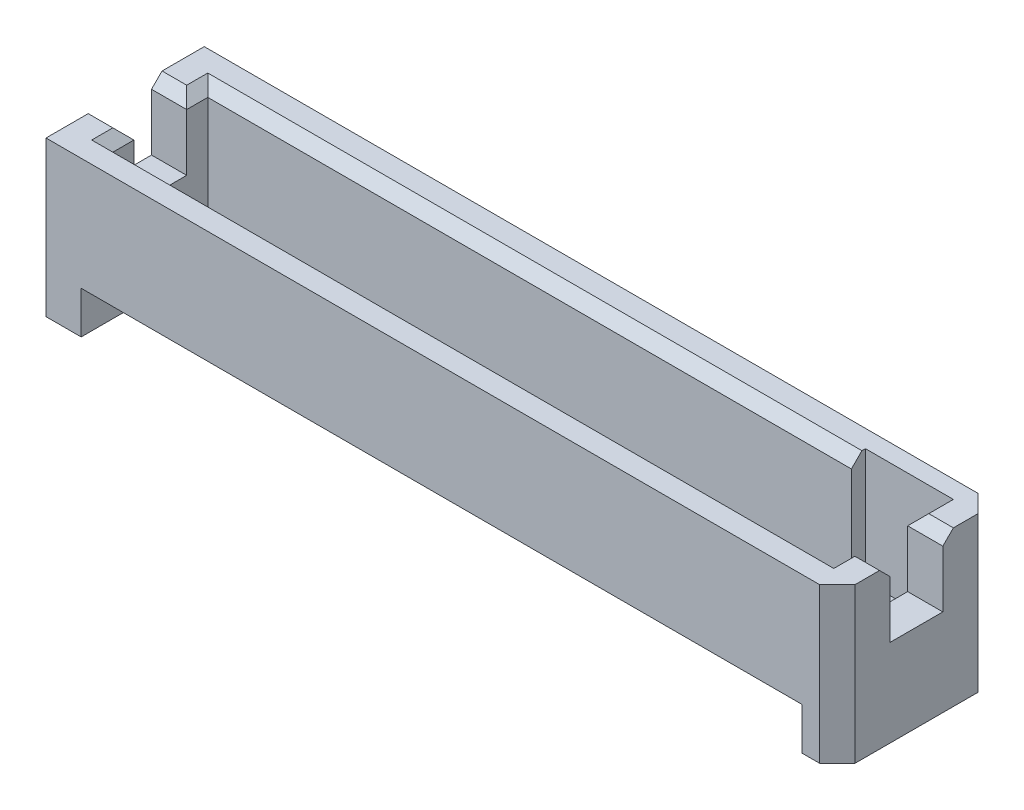
ISO-10303-21;
HEADER;
FILE_DESCRIPTION(('STEP AP214'),'2;1');
FILE_NAME('part.step','',(''),(''),'','','');
FILE_SCHEMA(('AUTOMOTIVE_DESIGN { 1 0 10303 214 1 1 1 1 }'));
ENDSEC;
DATA;
#1=APPLICATION_CONTEXT('core data for automotive mechanical design processes');
#2=APPLICATION_PROTOCOL_DEFINITION('international standard','automotive_design',2000,#1);
#3=PRODUCT_CONTEXT('',#1,'mechanical');
#4=PRODUCT('Part','Part','',(#3));
#5=PRODUCT_RELATED_PRODUCT_CATEGORY('part','',(#4));
#6=PRODUCT_DEFINITION_FORMATION('','',#4);
#7=PRODUCT_DEFINITION_CONTEXT('part definition',#1,'design');
#8=PRODUCT_DEFINITION('design','',#6,#7);
#9=PRODUCT_DEFINITION_SHAPE('','',#8);
#10=(LENGTH_UNIT() NAMED_UNIT(*) SI_UNIT(.MILLI.,.METRE.));
#11=(NAMED_UNIT(*) PLANE_ANGLE_UNIT() SI_UNIT($,.RADIAN.));
#12=(NAMED_UNIT(*) SI_UNIT($,.STERADIAN.) SOLID_ANGLE_UNIT());
#13=UNCERTAINTY_MEASURE_WITH_UNIT(LENGTH_MEASURE(1.E-05),#10,'distance_accuracy_value','');
#14=(GEOMETRIC_REPRESENTATION_CONTEXT(3) GLOBAL_UNCERTAINTY_ASSIGNED_CONTEXT((#13)) GLOBAL_UNIT_ASSIGNED_CONTEXT((#10,
#11,#12)) REPRESENTATION_CONTEXT('',''));
#15=CARTESIAN_POINT('',(0.,0.,0.));
#16=DIRECTION('',(0.,0.,1.));
#17=DIRECTION('',(1.,0.,0.));
#18=AXIS2_PLACEMENT_3D('',#15,#16,#17);
#19=CARTESIAN_POINT('',(13.6525,5.588,2.8575));
#20=DIRECTION('',(-0.707106781186547,0.,-0.707106781186548));
#21=DIRECTION('',(-0.707106781186548,0.,0.707106781186547));
#22=AXIS2_PLACEMENT_3D('',#19,#20,#21);
#23=PLANE('',#22);
#24=DIRECTION('',(0.707106781186548,0.,-0.707106781186547));
#25=VECTOR('',#24,1.);
#26=CARTESIAN_POINT('',(13.6525,0.,2.8575));
#27=LINE('',#26,#25);
#28=CARTESIAN_POINT('',(13.6525,0.,2.8575));
#29=VERTEX_POINT('',#28);
#30=CARTESIAN_POINT('',(14.2875,0.,2.2225));
#31=VERTEX_POINT('',#30);
#32=EDGE_CURVE('E11',#29,#31,#27,.T.);
#33=ORIENTED_EDGE('',*,*,#32,.T.);
#34=DIRECTION('',(0.,-1.,0.));
#35=VECTOR('',#34,1.);
#36=CARTESIAN_POINT('',(14.2875,5.588,2.2225));
#37=LINE('',#36,#35);
#38=CARTESIAN_POINT('',(14.2875,5.588,2.2225));
#39=VERTEX_POINT('',#38);
#40=EDGE_CURVE('E24',#39,#31,#37,.T.);
#41=ORIENTED_EDGE('',*,*,#40,.F.);
#42=DIRECTION('',(0.707106781186548,0.,-0.707106781186547));
#43=VECTOR('',#42,1.);
#44=CARTESIAN_POINT('',(13.6525,5.588,2.8575));
#45=LINE('',#44,#43);
#46=CARTESIAN_POINT('',(13.6525,5.588,2.8575));
#47=VERTEX_POINT('',#46);
#48=EDGE_CURVE('E660',#47,#39,#45,.T.);
#49=ORIENTED_EDGE('',*,*,#48,.F.);
#50=DIRECTION('',(0.,-1.,0.));
#51=VECTOR('',#50,1.);
#52=CARTESIAN_POINT('',(13.6525,5.588,2.8575));
#53=LINE('',#52,#51);
#54=EDGE_CURVE('E656',#47,#29,#53,.T.);
#55=ORIENTED_EDGE('',*,*,#54,.T.);
#56=EDGE_LOOP('',(#33,#41,#49,#55));
#57=FACE_BOUND('',#56,.T.);
#58=ADVANCED_FACE('F16',(#57),#23,.F.);
#59=CARTESIAN_POINT('',(-14.2875,5.588,2.8575));
#60=DIRECTION('',(0.,0.,-1.));
#61=DIRECTION('',(-1.,0.,0.));
#62=AXIS2_PLACEMENT_3D('',#59,#60,#61);
#63=PLANE('',#62);
#64=DIRECTION('',(-1.,0.,0.));
#65=VECTOR('',#64,1.);
#66=CARTESIAN_POINT('',(13.0175,1.524,2.8575));
#67=LINE('',#66,#65);
#68=CARTESIAN_POINT('',(13.0175,1.524,2.8575));
#69=VERTEX_POINT('',#68);
#70=CARTESIAN_POINT('',(-13.0175,1.524,2.8575));
#71=VERTEX_POINT('',#70);
#72=EDGE_CURVE('E651',#69,#71,#67,.T.);
#73=ORIENTED_EDGE('',*,*,#72,.F.);
#74=DIRECTION('',(0.,-1.,0.));
#75=VECTOR('',#74,1.);
#76=CARTESIAN_POINT('',(13.0175,1.524,2.8575));
#77=LINE('',#76,#75);
#78=CARTESIAN_POINT('',(13.0175,0.,2.8575));
#79=VERTEX_POINT('',#78);
#80=EDGE_CURVE('E647',#69,#79,#77,.T.);
#81=ORIENTED_EDGE('',*,*,#80,.T.);
#82=DIRECTION('',(1.,0.,0.));
#83=VECTOR('',#82,1.);
#84=CARTESIAN_POINT('',(-14.2875,0.,2.8575));
#85=LINE('',#84,#83);
#86=EDGE_CURVE('E642',#79,#29,#85,.T.);
#87=ORIENTED_EDGE('',*,*,#86,.T.);
#88=ORIENTED_EDGE('',*,*,#54,.F.);
#89=DIRECTION('',(1.,0.,0.));
#90=VECTOR('',#89,1.);
#91=CARTESIAN_POINT('',(-14.2875,5.588,2.8575));
#92=LINE('',#91,#90);
#93=CARTESIAN_POINT('',(-14.2875,5.588,2.8575));
#94=VERTEX_POINT('',#93);
#95=EDGE_CURVE('E637',#94,#47,#92,.T.);
#96=ORIENTED_EDGE('',*,*,#95,.F.);
#97=DIRECTION('',(0.,-1.,0.));
#98=VECTOR('',#97,1.);
#99=CARTESIAN_POINT('',(-14.2875,5.588,2.8575));
#100=LINE('',#99,#98);
#101=CARTESIAN_POINT('',(-14.2875,0.,2.8575));
#102=VERTEX_POINT('',#101);
#103=EDGE_CURVE('E633',#94,#102,#100,.T.);
#104=ORIENTED_EDGE('',*,*,#103,.T.);
#105=DIRECTION('',(1.,0.,0.));
#106=VECTOR('',#105,1.);
#107=CARTESIAN_POINT('',(-14.2875,0.,2.8575));
#108=LINE('',#107,#106);
#109=CARTESIAN_POINT('',(-13.0175,0.,2.8575));
#110=VERTEX_POINT('',#109);
#111=EDGE_CURVE('E629',#102,#110,#108,.T.);
#112=ORIENTED_EDGE('',*,*,#111,.T.);
#113=DIRECTION('',(0.,-1.,0.));
#114=VECTOR('',#113,1.);
#115=CARTESIAN_POINT('',(-13.0175,1.524,2.8575));
#116=LINE('',#115,#114);
#117=EDGE_CURVE('E624',#71,#110,#116,.T.);
#118=ORIENTED_EDGE('',*,*,#117,.F.);
#119=EDGE_LOOP('',(#73,#81,#87,#88,#96,#104,#112,#118));
#120=FACE_BOUND('',#119,.T.);
#121=ADVANCED_FACE('F676',(#120),#63,.F.);
#122=CARTESIAN_POINT('',(-13.0175,0.,0.));
#123=DIRECTION('',(1.,0.,0.));
#124=DIRECTION('',(0.,0.,-1.));
#125=AXIS2_PLACEMENT_3D('',#122,#123,#124);
#126=PLANE('',#125);
#127=DIRECTION('',(0.,0.496138938356834,0.868243142124459));
#128=VECTOR('',#127,1.);
#129=CARTESIAN_POINT('',(-13.0175,0.508,1.0795));
#130=LINE('',#129,#128);
#131=CARTESIAN_POINT('',(-13.0175,0.508,1.0795));
#132=VERTEX_POINT('',#131);
#133=EDGE_CURVE('E619',#132,#71,#130,.T.);
#134=ORIENTED_EDGE('',*,*,#133,.T.);
#135=ORIENTED_EDGE('',*,*,#117,.T.);
#136=DIRECTION('',(0.,0.,-1.));
#137=VECTOR('',#136,1.);
#138=CARTESIAN_POINT('',(-13.0175,0.,2.8575));
#139=LINE('',#138,#137);
#140=CARTESIAN_POINT('',(-13.0175,0.,-2.8575));
#141=VERTEX_POINT('',#140);
#142=EDGE_CURVE('E615',#110,#141,#139,.T.);
#143=ORIENTED_EDGE('',*,*,#142,.T.);
#144=DIRECTION('',(0.,1.,0.));
#145=VECTOR('',#144,1.);
#146=CARTESIAN_POINT('',(-13.0175,0.,-2.8575));
#147=LINE('',#146,#145);
#148=CARTESIAN_POINT('',(-13.0175,1.524,-2.8575));
#149=VERTEX_POINT('',#148);
#150=EDGE_CURVE('E611',#141,#149,#147,.T.);
#151=ORIENTED_EDGE('',*,*,#150,.T.);
#152=DIRECTION('',(0.,-0.496138938356834,0.868243142124459));
#153=VECTOR('',#152,1.);
#154=CARTESIAN_POINT('',(-13.0175,1.524,-2.8575));
#155=LINE('',#154,#153);
#156=CARTESIAN_POINT('',(-13.0175,0.508,-1.0795));
#157=VERTEX_POINT('',#156);
#158=EDGE_CURVE('E607',#149,#157,#155,.T.);
#159=ORIENTED_EDGE('',*,*,#158,.T.);
#160=DIRECTION('',(0.,0.,1.));
#161=VECTOR('',#160,1.);
#162=CARTESIAN_POINT('',(-13.0175,0.508,-1.0795));
#163=LINE('',#162,#161);
#164=EDGE_CURVE('E603',#157,#132,#163,.T.);
#165=ORIENTED_EDGE('',*,*,#164,.T.);
#166=EDGE_LOOP('',(#134,#135,#143,#151,#159,#165));
#167=FACE_BOUND('',#166,.T.);
#168=ADVANCED_FACE('F806',(#167),#126,.T.);
#169=CARTESIAN_POINT('',(13.0175,0.508,-1.0795));
#170=DIRECTION('',(0.,-1.,0.));
#171=DIRECTION('',(0.,0.,-1.));
#172=AXIS2_PLACEMENT_3D('',#169,#170,#171);
#173=PLANE('',#172);
#174=ORIENTED_EDGE('',*,*,#164,.F.);
#175=DIRECTION('',(-1.,0.,0.));
#176=VECTOR('',#175,1.);
#177=CARTESIAN_POINT('',(13.0175,0.508,-1.0795));
#178=LINE('',#177,#176);
#179=CARTESIAN_POINT('',(13.0175,0.508,-1.0795));
#180=VERTEX_POINT('',#179);
#181=EDGE_CURVE('E598',#180,#157,#178,.T.);
#182=ORIENTED_EDGE('',*,*,#181,.F.);
#183=DIRECTION('',(0.,0.,1.));
#184=VECTOR('',#183,1.);
#185=CARTESIAN_POINT('',(13.0175,0.508,-1.0795));
#186=LINE('',#185,#184);
#187=CARTESIAN_POINT('',(13.0175,0.508,1.0795));
#188=VERTEX_POINT('',#187);
#189=EDGE_CURVE('E594',#180,#188,#186,.T.);
#190=ORIENTED_EDGE('',*,*,#189,.T.);
#191=DIRECTION('',(-1.,0.,0.));
#192=VECTOR('',#191,1.);
#193=CARTESIAN_POINT('',(13.0175,0.508,1.0795));
#194=LINE('',#193,#192);
#195=EDGE_CURVE('E589',#188,#132,#194,.T.);
#196=ORIENTED_EDGE('',*,*,#195,.T.);
#197=EDGE_LOOP('',(#174,#182,#190,#196));
#198=FACE_BOUND('',#197,.T.);
#199=ADVANCED_FACE('F810',(#198),#173,.T.);
#200=CARTESIAN_POINT('',(13.0175,0.508,1.0795));
#201=DIRECTION('',(0.,-0.868243142124459,0.496138938356834));
#202=DIRECTION('',(0.,-0.496138938356834,-0.868243142124459));
#203=AXIS2_PLACEMENT_3D('',#200,#201,#202);
#204=PLANE('',#203);
#205=ORIENTED_EDGE('',*,*,#133,.F.);
#206=ORIENTED_EDGE('',*,*,#195,.F.);
#207=DIRECTION('',(0.,0.496138938356834,0.868243142124459));
#208=VECTOR('',#207,1.);
#209=CARTESIAN_POINT('',(13.0175,0.508,1.0795));
#210=LINE('',#209,#208);
#211=EDGE_CURVE('E584',#188,#69,#210,.T.);
#212=ORIENTED_EDGE('',*,*,#211,.T.);
#213=ORIENTED_EDGE('',*,*,#72,.T.);
#214=EDGE_LOOP('',(#205,#206,#212,#213));
#215=FACE_BOUND('',#214,.T.);
#216=ADVANCED_FACE('F816',(#215),#204,.T.);
#217=CARTESIAN_POINT('',(13.0175,0.,0.));
#218=DIRECTION('',(1.,0.,0.));
#219=DIRECTION('',(0.,0.,-1.));
#220=AXIS2_PLACEMENT_3D('',#217,#218,#219);
#221=PLANE('',#220);
#222=ORIENTED_EDGE('',*,*,#211,.F.);
#223=ORIENTED_EDGE('',*,*,#189,.F.);
#224=DIRECTION('',(0.,-0.496138938356834,0.868243142124459));
#225=VECTOR('',#224,1.);
#226=CARTESIAN_POINT('',(13.0175,1.524,-2.8575));
#227=LINE('',#226,#225);
#228=CARTESIAN_POINT('',(13.0175,1.524,-2.8575));
#229=VERTEX_POINT('',#228);
#230=EDGE_CURVE('E579',#229,#180,#227,.T.);
#231=ORIENTED_EDGE('',*,*,#230,.F.);
#232=DIRECTION('',(0.,1.,0.));
#233=VECTOR('',#232,1.);
#234=CARTESIAN_POINT('',(13.0175,0.,-2.8575));
#235=LINE('',#234,#233);
#236=CARTESIAN_POINT('',(13.0175,0.,-2.8575));
#237=VERTEX_POINT('',#236);
#238=EDGE_CURVE('E574',#237,#229,#235,.T.);
#239=ORIENTED_EDGE('',*,*,#238,.F.);
#240=DIRECTION('',(0.,0.,-1.));
#241=VECTOR('',#240,1.);
#242=CARTESIAN_POINT('',(13.0175,0.,2.8575));
#243=LINE('',#242,#241);
#244=EDGE_CURVE('E569',#79,#237,#243,.T.);
#245=ORIENTED_EDGE('',*,*,#244,.F.);
#246=ORIENTED_EDGE('',*,*,#80,.F.);
#247=EDGE_LOOP('',(#222,#223,#231,#239,#245,#246));
#248=FACE_BOUND('',#247,.T.);
#249=ADVANCED_FACE('F820',(#248),#221,.F.);
#250=CARTESIAN_POINT('',(0.,0.,0.));
#251=DIRECTION('',(0.,1.,0.));
#252=DIRECTION('',(0.,0.,1.));
#253=AXIS2_PLACEMENT_3D('',#250,#251,#252);
#254=PLANE('',#253);
#255=ORIENTED_EDGE('',*,*,#86,.F.);
#256=ORIENTED_EDGE('',*,*,#244,.T.);
#257=DIRECTION('',(-1.,0.,0.));
#258=VECTOR('',#257,1.);
#259=CARTESIAN_POINT('',(13.6525,0.,-2.8575));
#260=LINE('',#259,#258);
#261=CARTESIAN_POINT('',(13.6525,0.,-2.8575));
#262=VERTEX_POINT('',#261);
#263=EDGE_CURVE('E564',#262,#237,#260,.T.);
#264=ORIENTED_EDGE('',*,*,#263,.F.);
#265=DIRECTION('',(-0.707106781186548,0.,-0.707106781186547));
#266=VECTOR('',#265,1.);
#267=CARTESIAN_POINT('',(14.2875,0.,-2.2225));
#268=LINE('',#267,#266);
#269=CARTESIAN_POINT('',(14.2875,0.,-2.2225));
#270=VERTEX_POINT('',#269);
#271=EDGE_CURVE('E559',#270,#262,#268,.T.);
#272=ORIENTED_EDGE('',*,*,#271,.F.);
#273=DIRECTION('',(0.,0.,-1.));
#274=VECTOR('',#273,1.);
#275=CARTESIAN_POINT('',(14.2875,0.,2.2225));
#276=LINE('',#275,#274);
#277=EDGE_CURVE('E554',#31,#270,#276,.T.);
#278=ORIENTED_EDGE('',*,*,#277,.F.);
#279=ORIENTED_EDGE('',*,*,#32,.F.);
#280=EDGE_LOOP('',(#255,#256,#264,#272,#278,#279));
#281=FACE_BOUND('',#280,.T.);
#282=ADVANCED_FACE('F681',(#281),#254,.F.);
#283=CARTESIAN_POINT('',(14.2875,5.588,2.2225));
#284=DIRECTION('',(-1.,0.,0.));
#285=DIRECTION('',(0.,0.,1.));
#286=AXIS2_PLACEMENT_3D('',#283,#284,#285);
#287=PLANE('',#286);
#288=DIRECTION('',(0.,-0.707106781186548,-0.707106781186547));
#289=VECTOR('',#288,1.);
#290=CARTESIAN_POINT('',(14.2875,5.588,1.3335));
#291=LINE('',#290,#289);
#292=CARTESIAN_POINT('',(14.2875,5.588,1.3335));
#293=VERTEX_POINT('',#292);
#294=CARTESIAN_POINT('',(14.2875,5.207,0.9525));
#295=VERTEX_POINT('',#294);
#296=EDGE_CURVE('E549',#293,#295,#291,.T.);
#297=ORIENTED_EDGE('',*,*,#296,.F.);
#298=DIRECTION('',(0.,0.,-1.));
#299=VECTOR('',#298,1.);
#300=CARTESIAN_POINT('',(14.2875,5.588,2.2225));
#301=LINE('',#300,#299);
#302=EDGE_CURVE('E544',#39,#293,#301,.T.);
#303=ORIENTED_EDGE('',*,*,#302,.F.);
#304=ORIENTED_EDGE('',*,*,#40,.T.);
#305=ORIENTED_EDGE('',*,*,#277,.T.);
#306=DIRECTION('',(0.,-1.,0.));
#307=VECTOR('',#306,1.);
#308=CARTESIAN_POINT('',(14.2875,5.588,-2.2225));
#309=LINE('',#308,#307);
#310=CARTESIAN_POINT('',(14.2875,5.588,-2.2225));
#311=VERTEX_POINT('',#310);
#312=EDGE_CURVE('E539',#311,#270,#309,.T.);
#313=ORIENTED_EDGE('',*,*,#312,.F.);
#314=DIRECTION('',(0.,0.,-1.));
#315=VECTOR('',#314,1.);
#316=CARTESIAN_POINT('',(14.2875,5.588,2.2225));
#317=LINE('',#316,#315);
#318=CARTESIAN_POINT('',(14.2875,5.588,-1.3335));
#319=VERTEX_POINT('',#318);
#320=EDGE_CURVE('E534',#319,#311,#317,.T.);
#321=ORIENTED_EDGE('',*,*,#320,.F.);
#322=DIRECTION('',(0.,0.707106781186548,-0.707106781186547));
#323=VECTOR('',#322,1.);
#324=CARTESIAN_POINT('',(14.2875,5.207,-0.9525));
#325=LINE('',#324,#323);
#326=CARTESIAN_POINT('',(14.2875,5.207,-0.9525));
#327=VERTEX_POINT('',#326);
#328=EDGE_CURVE('E529',#327,#319,#325,.T.);
#329=ORIENTED_EDGE('',*,*,#328,.F.);
#330=DIRECTION('',(0.,-1.,0.));
#331=VECTOR('',#330,1.);
#332=CARTESIAN_POINT('',(14.2875,8.0264,-0.9525));
#333=LINE('',#332,#331);
#334=CARTESIAN_POINT('',(14.2875,3.1496,-0.9525));
#335=VERTEX_POINT('',#334);
#336=EDGE_CURVE('E525',#327,#335,#333,.T.);
#337=ORIENTED_EDGE('',*,*,#336,.T.);
#338=DIRECTION('',(0.,0.,-1.));
#339=VECTOR('',#338,1.);
#340=CARTESIAN_POINT('',(14.2875,3.1496,0.9525));
#341=LINE('',#340,#339);
#342=CARTESIAN_POINT('',(14.2875,3.1496,0.9525));
#343=VERTEX_POINT('',#342);
#344=EDGE_CURVE('E520',#343,#335,#341,.T.);
#345=ORIENTED_EDGE('',*,*,#344,.F.);
#346=DIRECTION('',(0.,-1.,0.));
#347=VECTOR('',#346,1.);
#348=CARTESIAN_POINT('',(14.2875,8.0264,0.9525));
#349=LINE('',#348,#347);
#350=EDGE_CURVE('E515',#295,#343,#349,.T.);
#351=ORIENTED_EDGE('',*,*,#350,.F.);
#352=EDGE_LOOP('',(#297,#303,#304,#305,#313,#321,#329,#337,#345,#351));
#353=FACE_BOUND('',#352,.T.);
#354=ADVANCED_FACE('F670',(#353),#287,.F.);
#355=CARTESIAN_POINT('',(-14.2875,8.0264,0.9525));
#356=DIRECTION('',(0.,0.,-1.));
#357=DIRECTION('',(-1.,0.,0.));
#358=AXIS2_PLACEMENT_3D('',#355,#356,#357);
#359=PLANE('',#358);
#360=DIRECTION('',(0.,-1.,0.));
#361=VECTOR('',#360,1.);
#362=CARTESIAN_POINT('',(13.0175,8.0264,0.9525));
#363=LINE('',#362,#361);
#364=CARTESIAN_POINT('',(13.0175,5.207,0.9525));
#365=VERTEX_POINT('',#364);
#366=CARTESIAN_POINT('',(13.0175,3.1496,0.9525));
#367=VERTEX_POINT('',#366);
#368=EDGE_CURVE('E510',#365,#367,#363,.T.);
#369=ORIENTED_EDGE('',*,*,#368,.F.);
#370=DIRECTION('',(-1.,0.,0.));
#371=VECTOR('',#370,1.);
#372=CARTESIAN_POINT('',(14.2875,5.207,0.9525));
#373=LINE('',#372,#371);
#374=EDGE_CURVE('E505',#295,#365,#373,.T.);
#375=ORIENTED_EDGE('',*,*,#374,.F.);
#376=ORIENTED_EDGE('',*,*,#350,.T.);
#377=DIRECTION('',(1.,0.,0.));
#378=VECTOR('',#377,1.);
#379=CARTESIAN_POINT('',(-14.2875,3.1496,0.9525));
#380=LINE('',#379,#378);
#381=EDGE_CURVE('E500',#367,#343,#380,.T.);
#382=ORIENTED_EDGE('',*,*,#381,.F.);
#383=EDGE_LOOP('',(#369,#375,#376,#382));
#384=FACE_BOUND('',#383,.T.);
#385=ADVANCED_FACE('F790',(#384),#359,.T.);
#386=CARTESIAN_POINT('',(0.,3.1496,0.));
#387=DIRECTION('',(0.,1.,0.));
#388=DIRECTION('',(0.,0.,1.));
#389=AXIS2_PLACEMENT_3D('',#386,#387,#388);
#390=PLANE('',#389);
#391=DIRECTION('',(0.,0.,-1.));
#392=VECTOR('',#391,1.);
#393=CARTESIAN_POINT('',(13.0175,3.1496,0.));
#394=LINE('',#393,#392);
#395=CARTESIAN_POINT('',(13.0175,3.1496,-0.9525));
#396=VERTEX_POINT('',#395);
#397=EDGE_CURVE('E495',#367,#396,#394,.T.);
#398=ORIENTED_EDGE('',*,*,#397,.F.);
#399=ORIENTED_EDGE('',*,*,#381,.T.);
#400=ORIENTED_EDGE('',*,*,#344,.T.);
#401=DIRECTION('',(-1.,0.,0.));
#402=VECTOR('',#401,1.);
#403=CARTESIAN_POINT('',(14.2875,3.1496,-0.9525));
#404=LINE('',#403,#402);
#405=EDGE_CURVE('E491',#335,#396,#404,.T.);
#406=ORIENTED_EDGE('',*,*,#405,.T.);
#407=EDGE_LOOP('',(#398,#399,#400,#406));
#408=FACE_BOUND('',#407,.T.);
#409=ADVANCED_FACE('F792',(#408),#390,.T.);
#410=CARTESIAN_POINT('',(14.2875,8.0264,-0.9525));
#411=DIRECTION('',(0.,0.,1.));
#412=DIRECTION('',(1.,0.,0.));
#413=AXIS2_PLACEMENT_3D('',#410,#411,#412);
#414=PLANE('',#413);
#415=ORIENTED_EDGE('',*,*,#336,.F.);
#416=DIRECTION('',(-1.,0.,0.));
#417=VECTOR('',#416,1.);
#418=CARTESIAN_POINT('',(14.2875,5.207,-0.9525));
#419=LINE('',#418,#417);
#420=CARTESIAN_POINT('',(13.0175,5.207,-0.9525));
#421=VERTEX_POINT('',#420);
#422=EDGE_CURVE('E487',#327,#421,#419,.T.);
#423=ORIENTED_EDGE('',*,*,#422,.T.);
#424=DIRECTION('',(0.,1.,0.));
#425=VECTOR('',#424,1.);
#426=CARTESIAN_POINT('',(13.0175,8.0264,-0.9525));
#427=LINE('',#426,#425);
#428=EDGE_CURVE('E482',#396,#421,#427,.T.);
#429=ORIENTED_EDGE('',*,*,#428,.F.);
#430=ORIENTED_EDGE('',*,*,#405,.F.);
#431=EDGE_LOOP('',(#415,#423,#429,#430));
#432=FACE_BOUND('',#431,.T.);
#433=ADVANCED_FACE('F697',(#432),#414,.T.);
#434=CARTESIAN_POINT('',(13.0175,1.4351,1.7145));
#435=DIRECTION('',(1.,0.,0.));
#436=DIRECTION('',(0.,0.,-1.));
#437=AXIS2_PLACEMENT_3D('',#434,#435,#436);
#438=PLANE('',#437);
#439=ORIENTED_EDGE('',*,*,#397,.T.);
#440=ORIENTED_EDGE('',*,*,#428,.T.);
#441=DIRECTION('',(0.,0.,-1.));
#442=VECTOR('',#441,1.);
#443=CARTESIAN_POINT('',(13.0175,5.207,1.7145));
#444=LINE('',#443,#442);
#445=CARTESIAN_POINT('',(13.0175,5.207,-2.2225));
#446=VERTEX_POINT('',#445);
#447=EDGE_CURVE('E478',#421,#446,#444,.T.);
#448=ORIENTED_EDGE('',*,*,#447,.T.);
#449=DIRECTION('',(0.,1.,0.));
#450=VECTOR('',#449,1.);
#451=CARTESIAN_POINT('',(13.0175,1.4351,-2.2225));
#452=LINE('',#451,#450);
#453=CARTESIAN_POINT('',(13.0175,1.4351,-2.2225));
#454=VERTEX_POINT('',#453);
#455=EDGE_CURVE('E474',#454,#446,#452,.T.);
#456=ORIENTED_EDGE('',*,*,#455,.F.);
#457=DIRECTION('',(0.,0.,-1.));
#458=VECTOR('',#457,1.);
#459=CARTESIAN_POINT('',(13.0175,1.4351,1.7145));
#460=LINE('',#459,#458);
#461=CARTESIAN_POINT('',(13.0175,1.4351,1.7145));
#462=VERTEX_POINT('',#461);
#463=EDGE_CURVE('E232',#462,#454,#460,.T.);
#464=ORIENTED_EDGE('',*,*,#463,.F.);
#465=DIRECTION('',(0.,1.,0.));
#466=VECTOR('',#465,1.);
#467=CARTESIAN_POINT('',(13.0175,1.4351,1.7145));
#468=LINE('',#467,#466);
#469=CARTESIAN_POINT('',(13.0175,5.207,1.7145));
#470=VERTEX_POINT('',#469);
#471=EDGE_CURVE('E467',#462,#470,#468,.T.);
#472=ORIENTED_EDGE('',*,*,#471,.T.);
#473=DIRECTION('',(0.,0.,-1.));
#474=VECTOR('',#473,1.);
#475=CARTESIAN_POINT('',(13.0175,5.207,1.7145));
#476=LINE('',#475,#474);
#477=EDGE_CURVE('E462',#470,#365,#476,.T.);
#478=ORIENTED_EDGE('',*,*,#477,.T.);
#479=ORIENTED_EDGE('',*,*,#368,.T.);
#480=EDGE_LOOP('',(#439,#440,#448,#456,#464,#472,#478,#479));
#481=FACE_BOUND('',#480,.T.);
#482=ADVANCED_FACE('F701',(#481),#438,.F.);
#483=CARTESIAN_POINT('',(13.0175,5.207,1.7145));
#484=DIRECTION('',(-0.707106781186548,0.707106781186548,0.));
#485=DIRECTION('',(-0.707106781186548,-0.707106781186548,0.));
#486=AXIS2_PLACEMENT_3D('',#483,#484,#485);
#487=PLANE('',#486);
#488=DIRECTION('',(0.,0.,-1.));
#489=VECTOR('',#488,1.);
#490=CARTESIAN_POINT('',(13.3985,5.588,1.7145));
#491=LINE('',#490,#489);
#492=CARTESIAN_POINT('',(13.3985,5.588,2.0955));
#493=VERTEX_POINT('',#492);
#494=CARTESIAN_POINT('',(13.3985,5.588,1.3335));
#495=VERTEX_POINT('',#494);
#496=EDGE_CURVE('E458',#493,#495,#491,.T.);
#497=ORIENTED_EDGE('',*,*,#496,.T.);
#498=DIRECTION('',(-0.577350269189626,-0.577350269189626,-0.577350269189625));
#499=VECTOR('',#498,1.);
#500=CARTESIAN_POINT('',(13.2715,5.461,1.2065));
#501=LINE('',#500,#499);
#502=EDGE_CURVE('E453',#495,#365,#501,.T.);
#503=ORIENTED_EDGE('',*,*,#502,.T.);
#504=ORIENTED_EDGE('',*,*,#477,.F.);
#505=DIRECTION('',(-0.577350269189626,-0.577350269189626,-0.577350269189626));
#506=VECTOR('',#505,1.);
#507=CARTESIAN_POINT('',(13.0175,5.207,1.7145));
#508=LINE('',#507,#506);
#509=EDGE_CURVE('E448',#493,#470,#508,.T.);
#510=ORIENTED_EDGE('',*,*,#509,.F.);
#511=EDGE_LOOP('',(#497,#503,#504,#510));
#512=FACE_BOUND('',#511,.T.);
#513=ADVANCED_FACE('F787',(#512),#487,.T.);
#514=CARTESIAN_POINT('',(-13.0175,5.207,1.7145));
#515=DIRECTION('',(0.,0.707106781186548,-0.707106781186548));
#516=DIRECTION('',(0.,0.707106781186548,0.707106781186548));
#517=AXIS2_PLACEMENT_3D('',#514,#515,#516);
#518=PLANE('',#517);
#519=DIRECTION('',(1.,0.,0.));
#520=VECTOR('',#519,1.);
#521=CARTESIAN_POINT('',(-13.0175,5.207,1.7145));
#522=LINE('',#521,#520);
#523=CARTESIAN_POINT('',(-13.0175,5.207,1.7145));
#524=VERTEX_POINT('',#523);
#525=EDGE_CURVE('E443',#524,#470,#522,.T.);
#526=ORIENTED_EDGE('',*,*,#525,.F.);
#527=DIRECTION('',(0.577350269189626,-0.577350269189626,-0.577350269189626));
#528=VECTOR('',#527,1.);
#529=CARTESIAN_POINT('',(-13.0175,5.207,1.7145));
#530=LINE('',#529,#528);
#531=CARTESIAN_POINT('',(-13.3985,5.588,2.0955));
#532=VERTEX_POINT('',#531);
#533=EDGE_CURVE('E438',#532,#524,#530,.T.);
#534=ORIENTED_EDGE('',*,*,#533,.F.);
#535=DIRECTION('',(1.,0.,0.));
#536=VECTOR('',#535,1.);
#537=CARTESIAN_POINT('',(-13.0175,5.588,2.0955));
#538=LINE('',#537,#536);
#539=EDGE_CURVE('E433',#532,#493,#538,.T.);
#540=ORIENTED_EDGE('',*,*,#539,.T.);
#541=ORIENTED_EDGE('',*,*,#509,.T.);
#542=EDGE_LOOP('',(#526,#534,#540,#541));
#543=FACE_BOUND('',#542,.T.);
#544=ADVANCED_FACE('F713',(#543),#518,.T.);
#545=CARTESIAN_POINT('',(0.,5.588,0.));
#546=DIRECTION('',(0.,1.,0.));
#547=DIRECTION('',(0.,0.,1.));
#548=AXIS2_PLACEMENT_3D('',#545,#546,#547);
#549=PLANE('',#548);
#550=ORIENTED_EDGE('',*,*,#302,.T.);
#551=DIRECTION('',(-1.,0.,0.));
#552=VECTOR('',#551,1.);
#553=CARTESIAN_POINT('',(14.2875,5.588,1.3335));
#554=LINE('',#553,#552);
#555=EDGE_CURVE('E428',#293,#495,#554,.T.);
#556=ORIENTED_EDGE('',*,*,#555,.T.);
#557=ORIENTED_EDGE('',*,*,#496,.F.);
#558=ORIENTED_EDGE('',*,*,#539,.F.);
#559=DIRECTION('',(0.,0.,1.));
#560=VECTOR('',#559,1.);
#561=CARTESIAN_POINT('',(-13.3985,5.588,-1.7145));
#562=LINE('',#561,#560);
#563=CARTESIAN_POINT('',(-13.3985,5.588,1.3335));
#564=VERTEX_POINT('',#563);
#565=EDGE_CURVE('E423',#564,#532,#562,.T.);
#566=ORIENTED_EDGE('',*,*,#565,.F.);
#567=DIRECTION('',(-1.,0.,0.));
#568=VECTOR('',#567,1.);
#569=CARTESIAN_POINT('',(14.2875,5.588,1.3335));
#570=LINE('',#569,#568);
#571=CARTESIAN_POINT('',(-14.2875,5.588,1.3335));
#572=VERTEX_POINT('',#571);
#573=EDGE_CURVE('E419',#564,#572,#570,.T.);
#574=ORIENTED_EDGE('',*,*,#573,.T.);
#575=DIRECTION('',(0.,0.,1.));
#576=VECTOR('',#575,1.);
#577=CARTESIAN_POINT('',(-14.2875,5.588,-2.8575));
#578=LINE('',#577,#576);
#579=EDGE_CURVE('E414',#572,#94,#578,.T.);
#580=ORIENTED_EDGE('',*,*,#579,.T.);
#581=ORIENTED_EDGE('',*,*,#95,.T.);
#582=ORIENTED_EDGE('',*,*,#48,.T.);
#583=EDGE_LOOP('',(#550,#556,#557,#558,#566,#574,#580,#581,#582));
#584=FACE_BOUND('',#583,.T.);
#585=ADVANCED_FACE('F673',(#584),#549,.T.);
#586=CARTESIAN_POINT('',(-14.2875,5.588,-2.8575));
#587=DIRECTION('',(1.,0.,0.));
#588=DIRECTION('',(0.,0.,-1.));
#589=AXIS2_PLACEMENT_3D('',#586,#587,#588);
#590=PLANE('',#589);
#591=DIRECTION('',(0.,-0.707106781186548,-0.707106781186547));
#592=VECTOR('',#591,1.);
#593=CARTESIAN_POINT('',(-14.2875,5.588,1.3335));
#594=LINE('',#593,#592);
#595=CARTESIAN_POINT('',(-14.2875,5.207,0.9525));
#596=VERTEX_POINT('',#595);
#597=EDGE_CURVE('E410',#572,#596,#594,.T.);
#598=ORIENTED_EDGE('',*,*,#597,.T.);
#599=DIRECTION('',(0.,-1.,0.));
#600=VECTOR('',#599,1.);
#601=CARTESIAN_POINT('',(-14.2875,8.0264,0.9525));
#602=LINE('',#601,#600);
#603=CARTESIAN_POINT('',(-14.2875,3.1496,0.9525));
#604=VERTEX_POINT('',#603);
#605=EDGE_CURVE('E406',#596,#604,#602,.T.);
#606=ORIENTED_EDGE('',*,*,#605,.T.);
#607=DIRECTION('',(0.,0.,1.));
#608=VECTOR('',#607,1.);
#609=CARTESIAN_POINT('',(-14.2875,3.1496,-0.9525));
#610=LINE('',#609,#608);
#611=CARTESIAN_POINT('',(-14.2875,3.1496,-0.9525));
#612=VERTEX_POINT('',#611);
#613=EDGE_CURVE('E401',#612,#604,#610,.T.);
#614=ORIENTED_EDGE('',*,*,#613,.F.);
#615=DIRECTION('',(0.,-1.,0.));
#616=VECTOR('',#615,1.);
#617=CARTESIAN_POINT('',(-14.2875,8.0264,-0.9525));
#618=LINE('',#617,#616);
#619=CARTESIAN_POINT('',(-14.2875,5.207,-0.9525));
#620=VERTEX_POINT('',#619);
#621=EDGE_CURVE('E396',#620,#612,#618,.T.);
#622=ORIENTED_EDGE('',*,*,#621,.F.);
#623=DIRECTION('',(0.,0.707106781186548,-0.707106781186547));
#624=VECTOR('',#623,1.);
#625=CARTESIAN_POINT('',(-14.2875,5.207,-0.9525));
#626=LINE('',#625,#624);
#627=CARTESIAN_POINT('',(-14.2875,5.588,-1.3335));
#628=VERTEX_POINT('',#627);
#629=EDGE_CURVE('E392',#620,#628,#626,.T.);
#630=ORIENTED_EDGE('',*,*,#629,.T.);
#631=DIRECTION('',(0.,0.,1.));
#632=VECTOR('',#631,1.);
#633=CARTESIAN_POINT('',(-14.2875,5.588,-2.8575));
#634=LINE('',#633,#632);
#635=CARTESIAN_POINT('',(-14.2875,5.588,-2.8575));
#636=VERTEX_POINT('',#635);
#637=EDGE_CURVE('E387',#636,#628,#634,.T.);
#638=ORIENTED_EDGE('',*,*,#637,.F.);
#639=DIRECTION('',(0.,-1.,0.));
#640=VECTOR('',#639,1.);
#641=CARTESIAN_POINT('',(-14.2875,5.588,-2.8575));
#642=LINE('',#641,#640);
#643=CARTESIAN_POINT('',(-14.2875,0.,-2.8575));
#644=VERTEX_POINT('',#643);
#645=EDGE_CURVE('E383',#636,#644,#642,.T.);
#646=ORIENTED_EDGE('',*,*,#645,.T.);
#647=DIRECTION('',(0.,0.,1.));
#648=VECTOR('',#647,1.);
#649=CARTESIAN_POINT('',(-14.2875,0.,-2.8575));
#650=LINE('',#649,#648);
#651=EDGE_CURVE('E378',#644,#102,#650,.T.);
#652=ORIENTED_EDGE('',*,*,#651,.T.);
#653=ORIENTED_EDGE('',*,*,#103,.F.);
#654=ORIENTED_EDGE('',*,*,#579,.F.);
#655=EDGE_LOOP('',(#598,#606,#614,#622,#630,#638,#646,#652,#653,#654));
#656=FACE_BOUND('',#655,.T.);
#657=ADVANCED_FACE('F781',(#656),#590,.F.);
#658=CARTESIAN_POINT('',(0.,0.,0.));
#659=DIRECTION('',(0.,1.,0.));
#660=DIRECTION('',(0.,0.,1.));
#661=AXIS2_PLACEMENT_3D('',#658,#659,#660);
#662=PLANE('',#661);
#663=ORIENTED_EDGE('',*,*,#142,.F.);
#664=ORIENTED_EDGE('',*,*,#111,.F.);
#665=ORIENTED_EDGE('',*,*,#651,.F.);
#666=DIRECTION('',(-1.,0.,0.));
#667=VECTOR('',#666,1.);
#668=CARTESIAN_POINT('',(13.6525,0.,-2.8575));
#669=LINE('',#668,#667);
#670=EDGE_CURVE('E373',#141,#644,#669,.T.);
#671=ORIENTED_EDGE('',*,*,#670,.F.);
#672=EDGE_LOOP('',(#663,#664,#665,#671));
#673=FACE_BOUND('',#672,.T.);
#674=ADVANCED_FACE('F892',(#673),#662,.F.);
#675=CARTESIAN_POINT('',(13.6525,5.588,-2.8575));
#676=DIRECTION('',(0.,0.,1.));
#677=DIRECTION('',(1.,0.,0.));
#678=AXIS2_PLACEMENT_3D('',#675,#676,#677);
#679=PLANE('',#678);
#680=ORIENTED_EDGE('',*,*,#263,.T.);
#681=ORIENTED_EDGE('',*,*,#238,.T.);
#682=DIRECTION('',(-1.,0.,0.));
#683=VECTOR('',#682,1.);
#684=CARTESIAN_POINT('',(13.0175,1.524,-2.8575));
#685=LINE('',#684,#683);
#686=EDGE_CURVE('E368',#229,#149,#685,.T.);
#687=ORIENTED_EDGE('',*,*,#686,.T.);
#688=ORIENTED_EDGE('',*,*,#150,.F.);
#689=ORIENTED_EDGE('',*,*,#670,.T.);
#690=ORIENTED_EDGE('',*,*,#645,.F.);
#691=DIRECTION('',(-1.,0.,0.));
#692=VECTOR('',#691,1.);
#693=CARTESIAN_POINT('',(13.6525,5.588,-2.8575));
#694=LINE('',#693,#692);
#695=CARTESIAN_POINT('',(13.6525,5.588,-2.8575));
#696=VERTEX_POINT('',#695);
#697=EDGE_CURVE('E363',#696,#636,#694,.T.);
#698=ORIENTED_EDGE('',*,*,#697,.F.);
#699=DIRECTION('',(0.,-1.,0.));
#700=VECTOR('',#699,1.);
#701=CARTESIAN_POINT('',(13.6525,5.588,-2.8575));
#702=LINE('',#701,#700);
#703=EDGE_CURVE('E358',#696,#262,#702,.T.);
#704=ORIENTED_EDGE('',*,*,#703,.T.);
#705=EDGE_LOOP('',(#680,#681,#687,#688,#689,#690,#698,#704));
#706=FACE_BOUND('',#705,.T.);
#707=ADVANCED_FACE('F901',(#706),#679,.F.);
#708=CARTESIAN_POINT('',(14.2875,5.588,-2.2225));
#709=DIRECTION('',(-0.707106781186547,0.,0.707106781186548));
#710=DIRECTION('',(0.707106781186548,0.,0.707106781186547));
#711=AXIS2_PLACEMENT_3D('',#708,#709,#710);
#712=PLANE('',#711);
#713=ORIENTED_EDGE('',*,*,#271,.T.);
#714=ORIENTED_EDGE('',*,*,#703,.F.);
#715=DIRECTION('',(-0.707106781186548,0.,-0.707106781186547));
#716=VECTOR('',#715,1.);
#717=CARTESIAN_POINT('',(14.2875,5.588,-2.2225));
#718=LINE('',#717,#716);
#719=EDGE_CURVE('E353',#311,#696,#718,.T.);
#720=ORIENTED_EDGE('',*,*,#719,.F.);
#721=ORIENTED_EDGE('',*,*,#312,.T.);
#722=EDGE_LOOP('',(#713,#714,#720,#721));
#723=FACE_BOUND('',#722,.T.);
#724=ADVANCED_FACE('F684',(#723),#712,.F.);
#725=CARTESIAN_POINT('',(0.,5.588,0.));
#726=DIRECTION('',(0.,1.,0.));
#727=DIRECTION('',(0.,0.,1.));
#728=AXIS2_PLACEMENT_3D('',#725,#726,#727);
#729=PLANE('',#728);
#730=DIRECTION('',(0.,0.,1.));
#731=VECTOR('',#730,1.);
#732=CARTESIAN_POINT('',(10.2235,5.588,-2.2225));
#733=LINE('',#732,#731);
#734=CARTESIAN_POINT('',(10.2235,5.588,-2.2225));
#735=VERTEX_POINT('',#734);
#736=CARTESIAN_POINT('',(10.2235,5.588,-2.0955));
#737=VERTEX_POINT('',#736);
#738=EDGE_CURVE('E349',#735,#737,#733,.T.);
#739=ORIENTED_EDGE('',*,*,#738,.F.);
#740=DIRECTION('',(-1.,0.,0.));
#741=VECTOR('',#740,1.);
#742=CARTESIAN_POINT('',(13.3985,5.588,-2.2225));
#743=LINE('',#742,#741);
#744=CARTESIAN_POINT('',(13.3985,5.588,-2.2225));
#745=VERTEX_POINT('',#744);
#746=EDGE_CURVE('E251',#745,#735,#743,.T.);
#747=ORIENTED_EDGE('',*,*,#746,.F.);
#748=DIRECTION('',(0.,0.,-1.));
#749=VECTOR('',#748,1.);
#750=CARTESIAN_POINT('',(13.3985,5.588,1.7145));
#751=LINE('',#750,#749);
#752=CARTESIAN_POINT('',(13.3985,5.588,-1.3335));
#753=VERTEX_POINT('',#752);
#754=EDGE_CURVE('E341',#753,#745,#751,.T.);
#755=ORIENTED_EDGE('',*,*,#754,.F.);
#756=DIRECTION('',(-1.,0.,0.));
#757=VECTOR('',#756,1.);
#758=CARTESIAN_POINT('',(14.2875,5.588,-1.3335));
#759=LINE('',#758,#757);
#760=EDGE_CURVE('E336',#319,#753,#759,.T.);
#761=ORIENTED_EDGE('',*,*,#760,.F.);
#762=ORIENTED_EDGE('',*,*,#320,.T.);
#763=ORIENTED_EDGE('',*,*,#719,.T.);
#764=ORIENTED_EDGE('',*,*,#697,.T.);
#765=ORIENTED_EDGE('',*,*,#637,.T.);
#766=DIRECTION('',(-1.,0.,0.));
#767=VECTOR('',#766,1.);
#768=CARTESIAN_POINT('',(14.2875,5.588,-1.3335));
#769=LINE('',#768,#767);
#770=CARTESIAN_POINT('',(-13.3985,5.588,-1.3335));
#771=VERTEX_POINT('',#770);
#772=EDGE_CURVE('E331',#771,#628,#769,.T.);
#773=ORIENTED_EDGE('',*,*,#772,.F.);
#774=DIRECTION('',(0.,0.,1.));
#775=VECTOR('',#774,1.);
#776=CARTESIAN_POINT('',(-13.3985,5.588,-1.7145));
#777=LINE('',#776,#775);
#778=CARTESIAN_POINT('',(-13.3985,5.588,-2.0955));
#779=VERTEX_POINT('',#778);
#780=EDGE_CURVE('E326',#779,#771,#777,.T.);
#781=ORIENTED_EDGE('',*,*,#780,.F.);
#782=DIRECTION('',(-1.,0.,0.));
#783=VECTOR('',#782,1.);
#784=CARTESIAN_POINT('',(13.0175,5.588,-2.0955));
#785=LINE('',#784,#783);
#786=EDGE_CURVE('E321',#737,#779,#785,.T.);
#787=ORIENTED_EDGE('',*,*,#786,.F.);
#788=EDGE_LOOP('',(#739,#747,#755,#761,#762,#763,#764,#765,#773,#781,#787));
#789=FACE_BOUND('',#788,.T.);
#790=ADVANCED_FACE('F689',(#789),#729,.T.);
#791=CARTESIAN_POINT('',(13.0175,5.207,-1.7145));
#792=DIRECTION('',(0.,0.707106781186548,0.707106781186548));
#793=DIRECTION('',(0.,-0.707106781186548,0.707106781186548));
#794=AXIS2_PLACEMENT_3D('',#791,#792,#793);
#795=PLANE('',#794);
#796=DIRECTION('',(0.,-0.707106781186548,0.707106781186548));
#797=VECTOR('',#796,1.);
#798=CARTESIAN_POINT('',(10.2235,5.207,-1.7145));
#799=LINE('',#798,#797);
#800=CARTESIAN_POINT('',(10.2235,5.207,-1.7145));
#801=VERTEX_POINT('',#800);
#802=EDGE_CURVE('E317',#737,#801,#799,.T.);
#803=ORIENTED_EDGE('',*,*,#802,.F.);
#804=ORIENTED_EDGE('',*,*,#786,.T.);
#805=DIRECTION('',(0.577350269189626,-0.577350269189626,0.577350269189626));
#806=VECTOR('',#805,1.);
#807=CARTESIAN_POINT('',(-13.0175,5.207,-1.7145));
#808=LINE('',#807,#806);
#809=CARTESIAN_POINT('',(-13.0175,5.207,-1.7145));
#810=VERTEX_POINT('',#809);
#811=EDGE_CURVE('E313',#779,#810,#808,.T.);
#812=ORIENTED_EDGE('',*,*,#811,.T.);
#813=DIRECTION('',(-1.,0.,0.));
#814=VECTOR('',#813,1.);
#815=CARTESIAN_POINT('',(13.0175,5.207,-1.7145));
#816=LINE('',#815,#814);
#817=EDGE_CURVE('E308',#801,#810,#816,.T.);
#818=ORIENTED_EDGE('',*,*,#817,.F.);
#819=EDGE_LOOP('',(#803,#804,#812,#818));
#820=FACE_BOUND('',#819,.T.);
#821=ADVANCED_FACE('F928',(#820),#795,.T.);
#822=CARTESIAN_POINT('',(13.0175,1.4351,-1.7145));
#823=DIRECTION('',(0.,0.,-1.));
#824=DIRECTION('',(-1.,0.,0.));
#825=AXIS2_PLACEMENT_3D('',#822,#823,#824);
#826=PLANE('',#825);
#827=DIRECTION('',(-1.,0.,0.));
#828=VECTOR('',#827,1.);
#829=CARTESIAN_POINT('',(13.0175,1.4351,-1.7145));
#830=LINE('',#829,#828);
#831=CARTESIAN_POINT('',(10.2235,1.4351,-1.7145));
#832=VERTEX_POINT('',#831);
#833=CARTESIAN_POINT('',(-13.0175,1.4351,-1.7145));
#834=VERTEX_POINT('',#833);
#835=EDGE_CURVE('E304',#832,#834,#830,.T.);
#836=ORIENTED_EDGE('',*,*,#835,.F.);
#837=DIRECTION('',(0.,1.,0.));
#838=VECTOR('',#837,1.);
#839=CARTESIAN_POINT('',(10.2235,1.4351,-1.7145));
#840=LINE('',#839,#838);
#841=EDGE_CURVE('E246',#832,#801,#840,.T.);
#842=ORIENTED_EDGE('',*,*,#841,.T.);
#843=ORIENTED_EDGE('',*,*,#817,.T.);
#844=DIRECTION('',(0.,1.,0.));
#845=VECTOR('',#844,1.);
#846=CARTESIAN_POINT('',(-13.0175,1.4351,-1.7145));
#847=LINE('',#846,#845);
#848=EDGE_CURVE('E296',#834,#810,#847,.T.);
#849=ORIENTED_EDGE('',*,*,#848,.F.);
#850=EDGE_LOOP('',(#836,#842,#843,#849));
#851=FACE_BOUND('',#850,.T.);
#852=ADVANCED_FACE('F937',(#851),#826,.F.);
#853=CARTESIAN_POINT('',(-13.0175,1.4351,-1.7145));
#854=DIRECTION('',(-1.,0.,0.));
#855=DIRECTION('',(0.,0.,1.));
#856=AXIS2_PLACEMENT_3D('',#853,#854,#855);
#857=PLANE('',#856);
#858=DIRECTION('',(0.,0.,1.));
#859=VECTOR('',#858,1.);
#860=CARTESIAN_POINT('',(-13.0175,5.207,-1.7145));
#861=LINE('',#860,#859);
#862=CARTESIAN_POINT('',(-13.0175,5.207,-0.9525));
#863=VERTEX_POINT('',#862);
#864=EDGE_CURVE('E292',#810,#863,#861,.T.);
#865=ORIENTED_EDGE('',*,*,#864,.T.);
#866=DIRECTION('',(0.,-1.,0.));
#867=VECTOR('',#866,1.);
#868=CARTESIAN_POINT('',(-13.0175,8.0264,-0.9525));
#869=LINE('',#868,#867);
#870=CARTESIAN_POINT('',(-13.0175,3.1496,-0.9525));
#871=VERTEX_POINT('',#870);
#872=EDGE_CURVE('E288',#863,#871,#869,.T.);
#873=ORIENTED_EDGE('',*,*,#872,.T.);
#874=DIRECTION('',(0.,0.,1.));
#875=VECTOR('',#874,1.);
#876=CARTESIAN_POINT('',(-13.0175,3.1496,0.));
#877=LINE('',#876,#875);
#878=CARTESIAN_POINT('',(-13.0175,3.1496,0.9525));
#879=VERTEX_POINT('',#878);
#880=EDGE_CURVE('E284',#871,#879,#877,.T.);
#881=ORIENTED_EDGE('',*,*,#880,.T.);
#882=DIRECTION('',(0.,1.,0.));
#883=VECTOR('',#882,1.);
#884=CARTESIAN_POINT('',(-13.0175,8.0264,0.9525));
#885=LINE('',#884,#883);
#886=CARTESIAN_POINT('',(-13.0175,5.207,0.9525));
#887=VERTEX_POINT('',#886);
#888=EDGE_CURVE('E280',#879,#887,#885,.T.);
#889=ORIENTED_EDGE('',*,*,#888,.T.);
#890=DIRECTION('',(0.,0.,1.));
#891=VECTOR('',#890,1.);
#892=CARTESIAN_POINT('',(-13.0175,5.207,-1.7145));
#893=LINE('',#892,#891);
#894=EDGE_CURVE('E275',#887,#524,#893,.T.);
#895=ORIENTED_EDGE('',*,*,#894,.T.);
#896=DIRECTION('',(0.,1.,0.));
#897=VECTOR('',#896,1.);
#898=CARTESIAN_POINT('',(-13.0175,1.4351,1.7145));
#899=LINE('',#898,#897);
#900=CARTESIAN_POINT('',(-13.0175,1.4351,1.7145));
#901=VERTEX_POINT('',#900);
#902=EDGE_CURVE('E270',#901,#524,#899,.T.);
#903=ORIENTED_EDGE('',*,*,#902,.F.);
#904=DIRECTION('',(0.,0.,1.));
#905=VECTOR('',#904,1.);
#906=CARTESIAN_POINT('',(-13.0175,1.4351,-1.7145));
#907=LINE('',#906,#905);
#908=EDGE_CURVE('E236',#834,#901,#907,.T.);
#909=ORIENTED_EDGE('',*,*,#908,.F.);
#910=ORIENTED_EDGE('',*,*,#848,.T.);
#911=EDGE_LOOP('',(#865,#873,#881,#889,#895,#903,#909,#910));
#912=FACE_BOUND('',#911,.T.);
#913=ADVANCED_FACE('F717',(#912),#857,.F.);
#914=CARTESIAN_POINT('',(0.,1.4351,0.));
#915=DIRECTION('',(0.,1.,0.));
#916=DIRECTION('',(0.,0.,1.));
#917=AXIS2_PLACEMENT_3D('',#914,#915,#916);
#918=PLANE('',#917);
#919=ORIENTED_EDGE('',*,*,#463,.T.);
#920=DIRECTION('',(1.,0.,0.));
#921=VECTOR('',#920,1.);
#922=CARTESIAN_POINT('',(10.2235,1.4351,-2.2225));
#923=LINE('',#922,#921);
#924=CARTESIAN_POINT('',(10.2235,1.4351,-2.2225));
#925=VERTEX_POINT('',#924);
#926=EDGE_CURVE('E225',#925,#454,#923,.T.);
#927=ORIENTED_EDGE('',*,*,#926,.F.);
#928=DIRECTION('',(0.,0.,1.));
#929=VECTOR('',#928,1.);
#930=CARTESIAN_POINT('',(10.2235,1.4351,-2.2225));
#931=LINE('',#930,#929);
#932=EDGE_CURVE('E229',#925,#832,#931,.T.);
#933=ORIENTED_EDGE('',*,*,#932,.T.);
#934=ORIENTED_EDGE('',*,*,#835,.T.);
#935=ORIENTED_EDGE('',*,*,#908,.T.);
#936=DIRECTION('',(1.,0.,0.));
#937=VECTOR('',#936,1.);
#938=CARTESIAN_POINT('',(-13.0175,1.4351,1.7145));
#939=LINE('',#938,#937);
#940=EDGE_CURVE('E247',#901,#462,#939,.T.);
#941=ORIENTED_EDGE('',*,*,#940,.T.);
#942=EDGE_LOOP('',(#919,#927,#933,#934,#935,#941));
#943=FACE_BOUND('',#942,.T.);
#944=ADVANCED_FACE('F227',(#943),#918,.T.);
#945=CARTESIAN_POINT('',(-13.0175,1.4351,1.7145));
#946=DIRECTION('',(0.,0.,1.));
#947=DIRECTION('',(1.,0.,0.));
#948=AXIS2_PLACEMENT_3D('',#945,#946,#947);
#949=PLANE('',#948);
#950=ORIENTED_EDGE('',*,*,#525,.T.);
#951=ORIENTED_EDGE('',*,*,#471,.F.);
#952=ORIENTED_EDGE('',*,*,#940,.F.);
#953=ORIENTED_EDGE('',*,*,#902,.T.);
#954=EDGE_LOOP('',(#950,#951,#952,#953));
#955=FACE_BOUND('',#954,.T.);
#956=ADVANCED_FACE('F711',(#955),#949,.F.);
#957=CARTESIAN_POINT('',(10.2235,5.588,-2.2225));
#958=DIRECTION('',(-1.,0.,0.));
#959=DIRECTION('',(0.,0.,1.));
#960=AXIS2_PLACEMENT_3D('',#957,#958,#959);
#961=PLANE('',#960);
#962=ORIENTED_EDGE('',*,*,#802,.T.);
#963=ORIENTED_EDGE('',*,*,#841,.F.);
#964=ORIENTED_EDGE('',*,*,#932,.F.);
#965=DIRECTION('',(0.,-1.,0.));
#966=VECTOR('',#965,1.);
#967=CARTESIAN_POINT('',(10.2235,5.588,-2.2225));
#968=LINE('',#967,#966);
#969=EDGE_CURVE('E243',#735,#925,#968,.T.);
#970=ORIENTED_EDGE('',*,*,#969,.F.);
#971=ORIENTED_EDGE('',*,*,#738,.T.);
#972=EDGE_LOOP('',(#962,#963,#964,#970,#971));
#973=FACE_BOUND('',#972,.T.);
#974=ADVANCED_FACE('F241',(#973),#961,.F.);
#975=CARTESIAN_POINT('',(0.,0.,-2.2225));
#976=DIRECTION('',(0.,0.,1.));
#977=DIRECTION('',(1.,0.,0.));
#978=AXIS2_PLACEMENT_3D('',#975,#976,#977);
#979=PLANE('',#978);
#980=ORIENTED_EDGE('',*,*,#746,.T.);
#981=ORIENTED_EDGE('',*,*,#969,.T.);
#982=ORIENTED_EDGE('',*,*,#926,.T.);
#983=ORIENTED_EDGE('',*,*,#455,.T.);
#984=DIRECTION('',(0.707106781186548,0.707106781186547,0.));
#985=VECTOR('',#984,1.);
#986=CARTESIAN_POINT('',(13.0175,5.207,-2.2225));
#987=LINE('',#986,#985);
#988=EDGE_CURVE('E252',#446,#745,#987,.T.);
#989=ORIENTED_EDGE('',*,*,#988,.T.);
#990=EDGE_LOOP('',(#980,#981,#982,#983,#989));
#991=FACE_BOUND('',#990,.T.);
#992=ADVANCED_FACE('F249',(#991),#979,.T.);
#993=CARTESIAN_POINT('',(13.0175,5.207,1.7145));
#994=DIRECTION('',(-0.707106781186548,0.707106781186548,0.));
#995=DIRECTION('',(-0.707106781186548,-0.707106781186548,0.));
#996=AXIS2_PLACEMENT_3D('',#993,#994,#995);
#997=PLANE('',#996);
#998=ORIENTED_EDGE('',*,*,#447,.F.);
#999=DIRECTION('',(0.577350269189626,0.577350269189626,-0.577350269189625));
#1000=VECTOR('',#999,1.);
#1001=CARTESIAN_POINT('',(12.1285,4.318,-0.0635000000000018));
#1002=LINE('',#1001,#1000);
#1003=EDGE_CURVE('E255',#421,#753,#1002,.T.);
#1004=ORIENTED_EDGE('',*,*,#1003,.T.);
#1005=ORIENTED_EDGE('',*,*,#754,.T.);
#1006=ORIENTED_EDGE('',*,*,#988,.F.);
#1007=EDGE_LOOP('',(#998,#1004,#1005,#1006));
#1008=FACE_BOUND('',#1007,.T.);
#1009=ADVANCED_FACE('F705',(#1008),#997,.T.);
#1010=CARTESIAN_POINT('',(14.2875,5.207,-0.9525));
#1011=DIRECTION('',(0.,0.707106781186547,0.707106781186548));
#1012=DIRECTION('',(0.,-0.707106781186548,0.707106781186547));
#1013=AXIS2_PLACEMENT_3D('',#1010,#1011,#1012);
#1014=PLANE('',#1013);
#1015=ORIENTED_EDGE('',*,*,#422,.F.);
#1016=ORIENTED_EDGE('',*,*,#328,.T.);
#1017=ORIENTED_EDGE('',*,*,#760,.T.);
#1018=ORIENTED_EDGE('',*,*,#1003,.F.);
#1019=EDGE_LOOP('',(#1015,#1016,#1017,#1018));
#1020=FACE_BOUND('',#1019,.T.);
#1021=ADVANCED_FACE('F694',(#1020),#1014,.T.);
#1022=CARTESIAN_POINT('',(-13.0175,5.207,-1.7145));
#1023=DIRECTION('',(0.707106781186548,0.707106781186548,0.));
#1024=DIRECTION('',(-0.707106781186548,0.707106781186548,0.));
#1025=AXIS2_PLACEMENT_3D('',#1022,#1023,#1024);
#1026=PLANE('',#1025);
#1027=ORIENTED_EDGE('',*,*,#894,.F.);
#1028=DIRECTION('',(-0.577350269189626,0.577350269189626,0.577350269189625));
#1029=VECTOR('',#1028,1.);
#1030=CARTESIAN_POINT('',(-12.1285,4.318,0.0635000000000013));
#1031=LINE('',#1030,#1029);
#1032=EDGE_CURVE('E723',#887,#564,#1031,.T.);
#1033=ORIENTED_EDGE('',*,*,#1032,.T.);
#1034=ORIENTED_EDGE('',*,*,#565,.T.);
#1035=ORIENTED_EDGE('',*,*,#533,.T.);
#1036=EDGE_LOOP('',(#1027,#1033,#1034,#1035));
#1037=FACE_BOUND('',#1036,.T.);
#1038=ADVANCED_FACE('F722',(#1037),#1026,.T.);
#1039=CARTESIAN_POINT('',(14.2875,5.588,1.3335));
#1040=DIRECTION('',(0.,0.707106781186547,-0.707106781186548));
#1041=DIRECTION('',(0.,0.707106781186548,0.707106781186547));
#1042=AXIS2_PLACEMENT_3D('',#1039,#1040,#1041);
#1043=PLANE('',#1042);
#1044=DIRECTION('',(-1.,0.,0.));
#1045=VECTOR('',#1044,1.);
#1046=CARTESIAN_POINT('',(14.2875,5.207,0.9525));
#1047=LINE('',#1046,#1045);
#1048=EDGE_CURVE('E730',#887,#596,#1047,.T.);
#1049=ORIENTED_EDGE('',*,*,#1048,.T.);
#1050=ORIENTED_EDGE('',*,*,#597,.F.);
#1051=ORIENTED_EDGE('',*,*,#573,.F.);
#1052=ORIENTED_EDGE('',*,*,#1032,.F.);
#1053=EDGE_LOOP('',(#1049,#1050,#1051,#1052));
#1054=FACE_BOUND('',#1053,.T.);
#1055=ADVANCED_FACE('F728',(#1054),#1043,.T.);
#1056=CARTESIAN_POINT('',(-14.2875,8.0264,0.9525));
#1057=DIRECTION('',(0.,0.,-1.));
#1058=DIRECTION('',(-1.,0.,0.));
#1059=AXIS2_PLACEMENT_3D('',#1056,#1057,#1058);
#1060=PLANE('',#1059);
#1061=ORIENTED_EDGE('',*,*,#605,.F.);
#1062=ORIENTED_EDGE('',*,*,#1048,.F.);
#1063=ORIENTED_EDGE('',*,*,#888,.F.);
#1064=DIRECTION('',(1.,0.,0.));
#1065=VECTOR('',#1064,1.);
#1066=CARTESIAN_POINT('',(-14.2875,3.1496,0.9525));
#1067=LINE('',#1066,#1065);
#1068=EDGE_CURVE('E737',#604,#879,#1067,.T.);
#1069=ORIENTED_EDGE('',*,*,#1068,.F.);
#1070=EDGE_LOOP('',(#1061,#1062,#1063,#1069));
#1071=FACE_BOUND('',#1070,.T.);
#1072=ADVANCED_FACE('F734',(#1071),#1060,.T.);
#1073=CARTESIAN_POINT('',(0.,3.1496,0.));
#1074=DIRECTION('',(0.,1.,0.));
#1075=DIRECTION('',(0.,0.,1.));
#1076=AXIS2_PLACEMENT_3D('',#1073,#1074,#1075);
#1077=PLANE('',#1076);
#1078=ORIENTED_EDGE('',*,*,#880,.F.);
#1079=DIRECTION('',(-1.,0.,0.));
#1080=VECTOR('',#1079,1.);
#1081=CARTESIAN_POINT('',(14.2875,3.1496,-0.9525));
#1082=LINE('',#1081,#1080);
#1083=EDGE_CURVE('E739',#871,#612,#1082,.T.);
#1084=ORIENTED_EDGE('',*,*,#1083,.T.);
#1085=ORIENTED_EDGE('',*,*,#613,.T.);
#1086=ORIENTED_EDGE('',*,*,#1068,.T.);
#1087=EDGE_LOOP('',(#1078,#1084,#1085,#1086));
#1088=FACE_BOUND('',#1087,.T.);
#1089=ADVANCED_FACE('F779',(#1088),#1077,.T.);
#1090=CARTESIAN_POINT('',(14.2875,8.0264,-0.9525));
#1091=DIRECTION('',(0.,0.,1.));
#1092=DIRECTION('',(1.,0.,0.));
#1093=AXIS2_PLACEMENT_3D('',#1090,#1091,#1092);
#1094=PLANE('',#1093);
#1095=ORIENTED_EDGE('',*,*,#872,.F.);
#1096=DIRECTION('',(-1.,0.,0.));
#1097=VECTOR('',#1096,1.);
#1098=CARTESIAN_POINT('',(14.2875,5.207,-0.9525));
#1099=LINE('',#1098,#1097);
#1100=EDGE_CURVE('E755',#863,#620,#1099,.T.);
#1101=ORIENTED_EDGE('',*,*,#1100,.T.);
#1102=ORIENTED_EDGE('',*,*,#621,.T.);
#1103=ORIENTED_EDGE('',*,*,#1083,.F.);
#1104=EDGE_LOOP('',(#1095,#1101,#1102,#1103));
#1105=FACE_BOUND('',#1104,.T.);
#1106=ADVANCED_FACE('F775',(#1105),#1094,.T.);
#1107=CARTESIAN_POINT('',(14.2875,5.207,-0.9525));
#1108=DIRECTION('',(0.,0.707106781186547,0.707106781186548));
#1109=DIRECTION('',(0.,-0.707106781186548,0.707106781186547));
#1110=AXIS2_PLACEMENT_3D('',#1107,#1108,#1109);
#1111=PLANE('',#1110);
#1112=ORIENTED_EDGE('',*,*,#772,.T.);
#1113=ORIENTED_EDGE('',*,*,#629,.F.);
#1114=ORIENTED_EDGE('',*,*,#1100,.F.);
#1115=DIRECTION('',(0.577350269189626,-0.577350269189626,0.577350269189625));
#1116=VECTOR('',#1115,1.);
#1117=CARTESIAN_POINT('',(-13.2715,5.461,-1.2065));
#1118=LINE('',#1117,#1116);
#1119=EDGE_CURVE('E760',#771,#863,#1118,.T.);
#1120=ORIENTED_EDGE('',*,*,#1119,.F.);
#1121=EDGE_LOOP('',(#1112,#1113,#1114,#1120));
#1122=FACE_BOUND('',#1121,.T.);
#1123=ADVANCED_FACE('F771',(#1122),#1111,.T.);
#1124=CARTESIAN_POINT('',(-13.0175,5.207,-1.7145));
#1125=DIRECTION('',(0.707106781186548,0.707106781186548,0.));
#1126=DIRECTION('',(-0.707106781186548,0.707106781186548,0.));
#1127=AXIS2_PLACEMENT_3D('',#1124,#1125,#1126);
#1128=PLANE('',#1127);
#1129=ORIENTED_EDGE('',*,*,#780,.T.);
#1130=ORIENTED_EDGE('',*,*,#1119,.T.);
#1131=ORIENTED_EDGE('',*,*,#864,.F.);
#1132=ORIENTED_EDGE('',*,*,#811,.F.);
#1133=EDGE_LOOP('',(#1129,#1130,#1131,#1132));
#1134=FACE_BOUND('',#1133,.T.);
#1135=ADVANCED_FACE('F767',(#1134),#1128,.T.);
#1136=CARTESIAN_POINT('',(13.0175,1.524,-2.8575));
#1137=DIRECTION('',(0.,-0.868243142124459,-0.496138938356834));
#1138=DIRECTION('',(0.,0.496138938356834,-0.868243142124459));
#1139=AXIS2_PLACEMENT_3D('',#1136,#1137,#1138);
#1140=PLANE('',#1139);
#1141=ORIENTED_EDGE('',*,*,#158,.F.);
#1142=ORIENTED_EDGE('',*,*,#686,.F.);
#1143=ORIENTED_EDGE('',*,*,#230,.T.);
#1144=ORIENTED_EDGE('',*,*,#181,.T.);
#1145=EDGE_LOOP('',(#1141,#1142,#1143,#1144));
#1146=FACE_BOUND('',#1145,.T.);
#1147=ADVANCED_FACE('F1060',(#1146),#1140,.T.);
#1148=CARTESIAN_POINT('',(14.2875,5.588,1.3335));
#1149=DIRECTION('',(0.,0.707106781186547,-0.707106781186548));
#1150=DIRECTION('',(0.,0.707106781186548,0.707106781186547));
#1151=AXIS2_PLACEMENT_3D('',#1148,#1149,#1150);
#1152=PLANE('',#1151);
#1153=ORIENTED_EDGE('',*,*,#555,.F.);
#1154=ORIENTED_EDGE('',*,*,#296,.T.);
#1155=ORIENTED_EDGE('',*,*,#374,.T.);
#1156=ORIENTED_EDGE('',*,*,#502,.F.);
#1157=EDGE_LOOP('',(#1153,#1154,#1155,#1156));
#1158=FACE_BOUND('',#1157,.T.);
#1159=ADVANCED_FACE('F1069',(#1158),#1152,.T.);
#1160=CLOSED_SHELL('',(#58,#121,#168,#199,#216,#249,#282,#354,#385,#409,#433,#482,#513,#544,
#585,#657,#674,#707,#724,#790,#821,#852,#913,#944,#956,#974,#992,#1009,#1021,#1038,#1055,#1072,
#1089,#1106,#1123,#1135,#1147,#1159));
#1161=MANIFOLD_SOLID_BREP('B1',#1160);
#1162=ADVANCED_BREP_SHAPE_REPRESENTATION('',(#18,#1161),#14);
#1163=SHAPE_DEFINITION_REPRESENTATION(#9,#1162);
ENDSEC;
END-ISO-10303-21;
